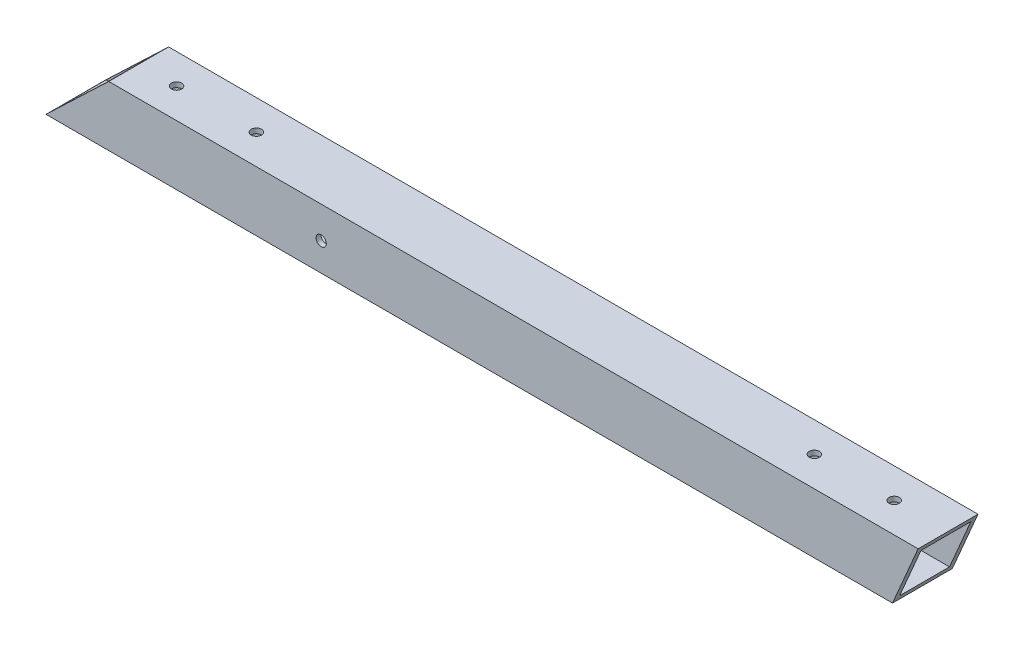
ISO-10303-21;
HEADER;
FILE_DESCRIPTION(('STEP AP214'),'2;1');
FILE_NAME('part.step','',(''),(''),'','','');
FILE_SCHEMA(('AUTOMOTIVE_DESIGN { 1 0 10303 214 1 1 1 1 }'));
ENDSEC;
DATA;
#1=APPLICATION_CONTEXT('core data for automotive mechanical design processes');
#2=APPLICATION_PROTOCOL_DEFINITION('international standard','automotive_design',2000,#1);
#3=PRODUCT_CONTEXT('',#1,'mechanical');
#4=PRODUCT('Part','Part','',(#3));
#5=PRODUCT_RELATED_PRODUCT_CATEGORY('part','',(#4));
#6=PRODUCT_DEFINITION_FORMATION('','',#4);
#7=PRODUCT_DEFINITION_CONTEXT('part definition',#1,'design');
#8=PRODUCT_DEFINITION('design','',#6,#7);
#9=PRODUCT_DEFINITION_SHAPE('','',#8);
#10=(LENGTH_UNIT() NAMED_UNIT(*) SI_UNIT(.MILLI.,.METRE.));
#11=(NAMED_UNIT(*) PLANE_ANGLE_UNIT() SI_UNIT($,.RADIAN.));
#12=(NAMED_UNIT(*) SI_UNIT($,.STERADIAN.) SOLID_ANGLE_UNIT());
#13=UNCERTAINTY_MEASURE_WITH_UNIT(LENGTH_MEASURE(1.E-05),#10,'distance_accuracy_value','');
#14=(GEOMETRIC_REPRESENTATION_CONTEXT(3) GLOBAL_UNCERTAINTY_ASSIGNED_CONTEXT((#13)) GLOBAL_UNIT_ASSIGNED_CONTEXT((#10,
#11,#12)) REPRESENTATION_CONTEXT('',''));
#15=CARTESIAN_POINT('',(0.,0.,0.));
#16=DIRECTION('',(0.,0.,1.));
#17=DIRECTION('',(1.,0.,0.));
#18=AXIS2_PLACEMENT_3D('',#15,#16,#17);
#19=CARTESIAN_POINT('',(-277.230526359531,38.0999999999998,-38.1));
#20=DIRECTION('',(0.,-1.,0.));
#21=DIRECTION('',(1.,0.,0.));
#22=AXIS2_PLACEMENT_3D('',#19,#20,#21);
#23=PLANE('',#22);
#24=CARTESIAN_POINT('',(-362.320526359531,38.1000000000001,-19.0499999999999));
#25=DIRECTION('',(0.,-1.,0.));
#26=DIRECTION('',(1.,0.,0.));
#27=AXIS2_PLACEMENT_3D('',#24,#25,#26);
#28=CIRCLE('',#27,3.2639);
#29=CARTESIAN_POINT('',(-359.056626359531,38.1000000000001,-19.0499999999999));
#30=VERTEX_POINT('',#29);
#31=EDGE_CURVE('E211',#30,#30,#28,.T.);
#32=ORIENTED_EDGE('',*,*,#31,.T.);
#33=EDGE_LOOP('',(#32));
#34=FACE_BOUND('',#33,.T.);
#35=CARTESIAN_POINT('',(-717.505350059974,38.1000000000002,-19.05));
#36=DIRECTION('',(0.,-1.,0.));
#37=DIRECTION('',(1.,0.,0.));
#38=AXIS2_PLACEMENT_3D('',#35,#36,#37);
#39=CIRCLE('',#38,3.2639);
#40=CARTESIAN_POINT('',(-714.241450059974,38.1000000000002,-19.05));
#41=VERTEX_POINT('',#40);
#42=EDGE_CURVE('E199',#41,#41,#39,.T.);
#43=ORIENTED_EDGE('',*,*,#42,.T.);
#44=EDGE_LOOP('',(#43));
#45=FACE_BOUND('',#44,.T.);
#46=CARTESIAN_POINT('',(-768.305350059974,38.1000000000002,-19.05));
#47=DIRECTION('',(0.,-1.,0.));
#48=DIRECTION('',(1.,0.,0.));
#49=AXIS2_PLACEMENT_3D('',#46,#47,#48);
#50=CIRCLE('',#49,3.2639);
#51=CARTESIAN_POINT('',(-765.041450059974,38.1000000000002,-19.05));
#52=VERTEX_POINT('',#51);
#53=EDGE_CURVE('E187',#52,#52,#50,.T.);
#54=ORIENTED_EDGE('',*,*,#53,.T.);
#55=EDGE_LOOP('',(#54));
#56=FACE_BOUND('',#55,.T.);
#57=CARTESIAN_POINT('',(-311.520526359531,38.1000000000001,-19.0499999999999));
#58=DIRECTION('',(0.,-1.,0.));
#59=DIRECTION('',(1.,0.,0.));
#60=AXIS2_PLACEMENT_3D('',#57,#58,#59);
#61=CIRCLE('',#60,3.2639);
#62=CARTESIAN_POINT('',(-308.256626359531,38.1000000000001,-19.0499999999999));
#63=VERTEX_POINT('',#62);
#64=EDGE_CURVE('E175',#63,#63,#61,.T.);
#65=ORIENTED_EDGE('',*,*,#64,.T.);
#66=EDGE_LOOP('',(#65));
#67=FACE_BOUND('',#66,.T.);
#68=DIRECTION('',(0.,0.,1.));
#69=VECTOR('',#68,1.);
#70=CARTESIAN_POINT('',(-277.230526359531,38.0999999999998,-38.1));
#71=LINE('',#70,#69);
#72=CARTESIAN_POINT('',(-277.230526359531,38.0999999999998,-38.1));
#73=VERTEX_POINT('',#72);
#74=CARTESIAN_POINT('',(-277.230526359531,38.0999999999998,0.));
#75=VERTEX_POINT('',#74);
#76=EDGE_CURVE('E162',#73,#75,#71,.T.);
#77=ORIENTED_EDGE('',*,*,#76,.F.);
#78=DIRECTION('',(-1.,0.,0.));
#79=VECTOR('',#78,1.);
#80=CARTESIAN_POINT('',(-277.230526359531,38.0999999999998,-38.1));
#81=LINE('',#80,#79);
#82=CARTESIAN_POINT('',(-792.435350059974,38.0999999999998,-38.1));
#83=VERTEX_POINT('',#82);
#84=EDGE_CURVE('E48',#73,#83,#81,.T.);
#85=ORIENTED_EDGE('',*,*,#84,.T.);
#86=DIRECTION('',(0.,0.,-1.));
#87=VECTOR('',#86,1.);
#88=CARTESIAN_POINT('',(-792.435350059974,38.0999999999998,-38.1));
#89=LINE('',#88,#87);
#90=CARTESIAN_POINT('',(-792.435350059974,38.0999999999998,0.));
#91=VERTEX_POINT('',#90);
#92=EDGE_CURVE('E125',#91,#83,#89,.T.);
#93=ORIENTED_EDGE('',*,*,#92,.F.);
#94=DIRECTION('',(-1.,0.,0.));
#95=VECTOR('',#94,1.);
#96=CARTESIAN_POINT('',(-277.230526359531,38.0999999999998,0.));
#97=LINE('',#96,#95);
#98=EDGE_CURVE('E129',#75,#91,#97,.T.);
#99=ORIENTED_EDGE('',*,*,#98,.F.);
#100=EDGE_LOOP('',(#77,#85,#93,#99));
#101=FACE_BOUND('',#100,.T.);
#102=ADVANCED_FACE('F33',(#34,#45,#56,#67,#101),#23,.F.);
#103=CARTESIAN_POINT('',(-277.230526359531,0.,0.));
#104=DIRECTION('',(0.,0.,-1.));
#105=DIRECTION('',(-0.690210929016375,0.723608232033296,0.));
#106=AXIS2_PLACEMENT_3D('',#103,#104,#105);
#107=PLANE('',#106);
#108=CARTESIAN_POINT('',(-657.229771370657,17.8823859969905,0.));
#109=DIRECTION('',(0.,0.,1.));
#110=DIRECTION('',(0.690210929016375,-0.723608232033296,0.));
#111=AXIS2_PLACEMENT_3D('',#108,#109,#110);
#112=CIRCLE('',#111,3.26389999999999);
#113=CARTESIAN_POINT('',(-654.97699191944,15.5206010884571,0.));
#114=VERTEX_POINT('',#113);
#115=EDGE_CURVE('E172',#114,#114,#112,.T.);
#116=ORIENTED_EDGE('',*,*,#115,.F.);
#117=EDGE_LOOP('',(#116));
#118=FACE_BOUND('',#117,.T.);
#119=DIRECTION('',(-0.393566430849752,-0.919296178882621,0.));
#120=VECTOR('',#119,1.);
#121=CARTESIAN_POINT('',(-291.015263179766,5.90148180223804,0.));
#122=LINE('',#121,#120);
#123=CARTESIAN_POINT('',(-293.541788561884,0.,0.));
#124=VERTEX_POINT('',#123);
#125=EDGE_CURVE('E159',#75,#124,#122,.T.);
#126=ORIENTED_EDGE('',*,*,#125,.F.);
#127=ORIENTED_EDGE('',*,*,#98,.T.);
#128=DIRECTION('',(-0.723608232033296,-0.690210929016375,0.));
#129=VECTOR('',#128,1.);
#130=CARTESIAN_POINT('',(-821.338830489497,10.5305263595312,0.));
#131=LINE('',#130,#129);
#132=CARTESIAN_POINT('',(-832.37889844707,0.,0.));
#133=VERTEX_POINT('',#132);
#134=EDGE_CURVE('E148',#91,#133,#131,.T.);
#135=ORIENTED_EDGE('',*,*,#134,.T.);
#136=DIRECTION('',(-1.,0.,0.));
#137=VECTOR('',#136,1.);
#138=CARTESIAN_POINT('',(-277.230526359531,0.,0.));
#139=LINE('',#138,#137);
#140=EDGE_CURVE('E127',#124,#133,#139,.T.);
#141=ORIENTED_EDGE('',*,*,#140,.F.);
#142=EDGE_LOOP('',(#126,#127,#135,#141));
#143=FACE_BOUND('',#142,.T.);
#144=ADVANCED_FACE('F238',(#118,#143),#107,.F.);
#145=CARTESIAN_POINT('',(-277.230526359531,0.,-38.1));
#146=DIRECTION('',(0.,1.,0.));
#147=DIRECTION('',(-1.,0.,0.));
#148=AXIS2_PLACEMENT_3D('',#145,#146,#147);
#149=PLANE('',#148);
#150=CARTESIAN_POINT('',(-311.520526359531,0.,-19.0499999999999));
#151=DIRECTION('',(0.,-1.,0.));
#152=DIRECTION('',(1.,0.,0.));
#153=AXIS2_PLACEMENT_3D('',#150,#151,#152);
#154=CIRCLE('',#153,3.26389999999999);
#155=CARTESIAN_POINT('',(-308.256626359531,0.,-19.0499999999999));
#156=VERTEX_POINT('',#155);
#157=EDGE_CURVE('E217',#156,#156,#154,.F.);
#158=ORIENTED_EDGE('',*,*,#157,.T.);
#159=EDGE_LOOP('',(#158));
#160=FACE_BOUND('',#159,.T.);
#161=CARTESIAN_POINT('',(-362.320526359531,0.,-19.0499999999999));
#162=DIRECTION('',(0.,-1.,0.));
#163=DIRECTION('',(1.,0.,0.));
#164=AXIS2_PLACEMENT_3D('',#161,#162,#163);
#165=CIRCLE('',#164,3.26389999999999);
#166=CARTESIAN_POINT('',(-359.056626359531,0.,-19.0499999999999));
#167=VERTEX_POINT('',#166);
#168=EDGE_CURVE('E205',#167,#167,#165,.F.);
#169=ORIENTED_EDGE('',*,*,#168,.T.);
#170=EDGE_LOOP('',(#169));
#171=FACE_BOUND('',#170,.T.);
#172=CARTESIAN_POINT('',(-717.505350059973,2.22044604925031E-13,-19.05));
#173=DIRECTION('',(0.,-1.,0.));
#174=DIRECTION('',(1.,0.,0.));
#175=AXIS2_PLACEMENT_3D('',#172,#173,#174);
#176=CIRCLE('',#175,3.26389999999999);
#177=CARTESIAN_POINT('',(-714.241450059974,2.21138690692513E-13,-19.05));
#178=VERTEX_POINT('',#177);
#179=EDGE_CURVE('E193',#178,#178,#176,.F.);
#180=ORIENTED_EDGE('',*,*,#179,.T.);
#181=EDGE_LOOP('',(#180));
#182=FACE_BOUND('',#181,.T.);
#183=CARTESIAN_POINT('',(-768.305350059973,2.22044604925031E-13,-19.05));
#184=DIRECTION('',(0.,-1.,0.));
#185=DIRECTION('',(1.,0.,0.));
#186=AXIS2_PLACEMENT_3D('',#183,#184,#185);
#187=CIRCLE('',#186,3.26389999999999);
#188=CARTESIAN_POINT('',(-765.041450059973,2.21138690692513E-13,-19.05));
#189=VERTEX_POINT('',#188);
#190=EDGE_CURVE('E181',#189,#189,#187,.F.);
#191=ORIENTED_EDGE('',*,*,#190,.T.);
#192=EDGE_LOOP('',(#191));
#193=FACE_BOUND('',#192,.T.);
#194=DIRECTION('',(0.,0.,-1.));
#195=VECTOR('',#194,1.);
#196=CARTESIAN_POINT('',(-293.541788561884,0.,-38.1));
#197=LINE('',#196,#195);
#198=CARTESIAN_POINT('',(-293.541788561884,0.,-38.1));
#199=VERTEX_POINT('',#198);
#200=EDGE_CURVE('E156',#124,#199,#197,.T.);
#201=ORIENTED_EDGE('',*,*,#200,.F.);
#202=ORIENTED_EDGE('',*,*,#140,.T.);
#203=DIRECTION('',(0.,0.,1.));
#204=VECTOR('',#203,1.);
#205=CARTESIAN_POINT('',(-832.37889844707,0.,-38.1));
#206=LINE('',#205,#204);
#207=CARTESIAN_POINT('',(-832.37889844707,-1.11022302462516E-13,-38.1));
#208=VERTEX_POINT('',#207);
#209=EDGE_CURVE('E139',#208,#133,#206,.T.);
#210=ORIENTED_EDGE('',*,*,#209,.F.);
#211=DIRECTION('',(-1.,0.,0.));
#212=VECTOR('',#211,1.);
#213=CARTESIAN_POINT('',(-277.230526359531,0.,-38.1));
#214=LINE('',#213,#212);
#215=EDGE_CURVE('E124',#199,#208,#214,.T.);
#216=ORIENTED_EDGE('',*,*,#215,.F.);
#217=EDGE_LOOP('',(#201,#202,#210,#216));
#218=FACE_BOUND('',#217,.T.);
#219=ADVANCED_FACE('F234',(#160,#171,#182,#193,#218),#149,.F.);
#220=CARTESIAN_POINT('',(-277.230526359531,0.,-38.1));
#221=DIRECTION('',(0.,0.,1.));
#222=DIRECTION('',(0.690210929016375,-0.723608232033296,0.));
#223=AXIS2_PLACEMENT_3D('',#220,#221,#222);
#224=PLANE('',#223);
#225=CARTESIAN_POINT('',(-657.229771370657,17.8823859969905,-38.1));
#226=DIRECTION('',(0.,0.,1.));
#227=DIRECTION('',(0.690210929016375,-0.723608232033296,0.));
#228=AXIS2_PLACEMENT_3D('',#225,#226,#227);
#229=CIRCLE('',#228,3.26389999999999);
#230=CARTESIAN_POINT('',(-654.97699191944,15.5206010884571,-38.1));
#231=VERTEX_POINT('',#230);
#232=EDGE_CURVE('E110',#231,#231,#229,.T.);
#233=ORIENTED_EDGE('',*,*,#232,.T.);
#234=EDGE_LOOP('',(#233));
#235=FACE_BOUND('',#234,.T.);
#236=DIRECTION('',(0.393566430849752,0.919296178882621,0.));
#237=VECTOR('',#236,1.);
#238=CARTESIAN_POINT('',(-291.015263179766,5.90148180223804,-38.1));
#239=LINE('',#238,#237);
#240=EDGE_CURVE('E153',#199,#73,#239,.T.);
#241=ORIENTED_EDGE('',*,*,#240,.F.);
#242=ORIENTED_EDGE('',*,*,#215,.T.);
#243=DIRECTION('',(-0.723608232033296,-0.690210929016375,0.));
#244=VECTOR('',#243,1.);
#245=CARTESIAN_POINT('',(-821.338830489497,10.5305263595312,-38.1));
#246=LINE('',#245,#244);
#247=EDGE_CURVE('E150',#83,#208,#246,.T.);
#248=ORIENTED_EDGE('',*,*,#247,.F.);
#249=ORIENTED_EDGE('',*,*,#84,.F.);
#250=EDGE_LOOP('',(#241,#242,#248,#249));
#251=FACE_BOUND('',#250,.T.);
#252=ADVANCED_FACE('F237',(#235,#251),#224,.F.);
#253=CARTESIAN_POINT('',(-821.338830489497,10.5305263595312,-38.1));
#254=DIRECTION('',(-0.690210929016375,0.723608232033296,0.));
#255=DIRECTION('',(-0.723608232033296,-0.690210929016375,0.));
#256=AXIS2_PLACEMENT_3D('',#253,#254,#255);
#257=PLANE('',#256);
#258=DIRECTION('',(0.723608232033296,0.690210929016375,0.));
#259=VECTOR('',#258,1.);
#260=CARTESIAN_POINT('',(-540.112555397144,278.777127216852,-3.175));
#261=LINE('',#260,#259);
#262=CARTESIAN_POINT('',(-829.050269414812,3.17499999999993,-3.175));
#263=VERTEX_POINT('',#262);
#264=CARTESIAN_POINT('',(-795.763979092232,34.9249999999999,-3.175));
#265=VERTEX_POINT('',#264);
#266=EDGE_CURVE('E41',#263,#265,#261,.T.);
#267=ORIENTED_EDGE('',*,*,#266,.F.);
#268=DIRECTION('',(0.,0.,1.));
#269=VECTOR('',#268,1.);
#270=CARTESIAN_POINT('',(-829.050269414812,3.17499999999982,-34.925));
#271=LINE('',#270,#269);
#272=CARTESIAN_POINT('',(-829.050269414812,3.17499999999982,-34.925));
#273=VERTEX_POINT('',#272);
#274=EDGE_CURVE('E145',#273,#263,#271,.T.);
#275=ORIENTED_EDGE('',*,*,#274,.F.);
#276=DIRECTION('',(-0.723608232033296,-0.690210929016375,0.));
#277=VECTOR('',#276,1.);
#278=CARTESIAN_POINT('',(-540.112555397144,278.777127216852,-34.925));
#279=LINE('',#278,#277);
#280=CARTESIAN_POINT('',(-795.763979092232,34.9249999999999,-34.925));
#281=VERTEX_POINT('',#280);
#282=EDGE_CURVE('E143',#281,#273,#279,.T.);
#283=ORIENTED_EDGE('',*,*,#282,.F.);
#284=DIRECTION('',(0.,0.,-1.));
#285=VECTOR('',#284,1.);
#286=CARTESIAN_POINT('',(-795.763979092232,34.9249999999999,-34.925));
#287=LINE('',#286,#285);
#288=EDGE_CURVE('E115',#265,#281,#287,.T.);
#289=ORIENTED_EDGE('',*,*,#288,.F.);
#290=EDGE_LOOP('',(#267,#275,#283,#289));
#291=FACE_BOUND('',#290,.T.);
#292=ORIENTED_EDGE('',*,*,#92,.T.);
#293=ORIENTED_EDGE('',*,*,#247,.T.);
#294=ORIENTED_EDGE('',*,*,#209,.T.);
#295=ORIENTED_EDGE('',*,*,#134,.F.);
#296=EDGE_LOOP('',(#292,#293,#294,#295));
#297=FACE_BOUND('',#296,.T.);
#298=ADVANCED_FACE('F252',(#291,#297),#257,.T.);
#299=CARTESIAN_POINT('',(-277.230526359531,34.9249999999999,-34.925));
#300=DIRECTION('',(0.,-1.,0.));
#301=DIRECTION('',(1.,0.,0.));
#302=AXIS2_PLACEMENT_3D('',#299,#300,#301);
#303=PLANE('',#302);
#304=CARTESIAN_POINT('',(-362.320526359531,34.925,-19.0499999999999));
#305=DIRECTION('',(0.,1.,0.));
#306=DIRECTION('',(-1.,0.,0.));
#307=AXIS2_PLACEMENT_3D('',#304,#305,#306);
#308=CIRCLE('',#307,3.26389999999999);
#309=CARTESIAN_POINT('',(-365.584426359532,34.925,-19.0499999999999));
#310=VERTEX_POINT('',#309);
#311=EDGE_CURVE('E214',#310,#310,#308,.T.);
#312=ORIENTED_EDGE('',*,*,#311,.T.);
#313=EDGE_LOOP('',(#312));
#314=FACE_BOUND('',#313,.T.);
#315=CARTESIAN_POINT('',(-717.505350059974,34.9250000000001,-19.05));
#316=DIRECTION('',(0.,1.,0.));
#317=DIRECTION('',(-1.,0.,0.));
#318=AXIS2_PLACEMENT_3D('',#315,#316,#317);
#319=CIRCLE('',#318,3.26389999999999);
#320=CARTESIAN_POINT('',(-720.769250059974,34.9250000000001,-19.05));
#321=VERTEX_POINT('',#320);
#322=EDGE_CURVE('E202',#321,#321,#319,.T.);
#323=ORIENTED_EDGE('',*,*,#322,.T.);
#324=EDGE_LOOP('',(#323));
#325=FACE_BOUND('',#324,.T.);
#326=CARTESIAN_POINT('',(-768.305350059973,34.9250000000001,-19.05));
#327=DIRECTION('',(0.,1.,0.));
#328=DIRECTION('',(-1.,0.,0.));
#329=AXIS2_PLACEMENT_3D('',#326,#327,#328);
#330=CIRCLE('',#329,3.26389999999999);
#331=CARTESIAN_POINT('',(-771.569250059973,34.9250000000001,-19.05));
#332=VERTEX_POINT('',#331);
#333=EDGE_CURVE('E190',#332,#332,#330,.T.);
#334=ORIENTED_EDGE('',*,*,#333,.T.);
#335=EDGE_LOOP('',(#334));
#336=FACE_BOUND('',#335,.T.);
#337=CARTESIAN_POINT('',(-311.520526359531,34.925,-19.0499999999999));
#338=DIRECTION('',(0.,1.,0.));
#339=DIRECTION('',(-1.,0.,0.));
#340=AXIS2_PLACEMENT_3D('',#337,#338,#339);
#341=CIRCLE('',#340,3.26389999999999);
#342=CARTESIAN_POINT('',(-314.784426359531,34.925,-19.0499999999999));
#343=VERTEX_POINT('',#342);
#344=EDGE_CURVE('E178',#343,#343,#341,.T.);
#345=ORIENTED_EDGE('',*,*,#344,.T.);
#346=EDGE_LOOP('',(#345));
#347=FACE_BOUND('',#346,.T.);
#348=DIRECTION('',(-1.,0.,0.));
#349=VECTOR('',#348,1.);
#350=CARTESIAN_POINT('',(-277.230526359531,34.9249999999999,-34.925));
#351=LINE('',#350,#349);
#352=CARTESIAN_POINT('',(-278.589798209727,34.9249999999999,-34.925));
#353=VERTEX_POINT('',#352);
#354=EDGE_CURVE('E105',#353,#281,#351,.T.);
#355=ORIENTED_EDGE('',*,*,#354,.F.);
#356=DIRECTION('',(0.,0.,1.));
#357=VECTOR('',#356,1.);
#358=CARTESIAN_POINT('',(-278.589798209727,34.9249999999999,-34.925));
#359=LINE('',#358,#357);
#360=CARTESIAN_POINT('',(-278.589798209727,34.9249999999999,-3.175));
#361=VERTEX_POINT('',#360);
#362=EDGE_CURVE('E11',#353,#361,#359,.T.);
#363=ORIENTED_EDGE('',*,*,#362,.T.);
#364=DIRECTION('',(-1.,0.,0.));
#365=VECTOR('',#364,1.);
#366=CARTESIAN_POINT('',(-277.230526359531,34.9249999999999,-3.175));
#367=LINE('',#366,#365);
#368=EDGE_CURVE('E130',#361,#265,#367,.T.);
#369=ORIENTED_EDGE('',*,*,#368,.T.);
#370=ORIENTED_EDGE('',*,*,#288,.T.);
#371=EDGE_LOOP('',(#355,#363,#369,#370));
#372=FACE_BOUND('',#371,.T.);
#373=ADVANCED_FACE('F113',(#314,#325,#336,#347,#372),#303,.T.);
#374=CARTESIAN_POINT('',(-277.230526359531,3.17499999999982,-34.925));
#375=DIRECTION('',(0.,0.,1.));
#376=DIRECTION('',(0.690210929016375,-0.723608232033296,0.));
#377=AXIS2_PLACEMENT_3D('',#374,#375,#376);
#378=PLANE('',#377);
#379=CARTESIAN_POINT('',(-657.229771370657,17.8823859969905,-34.925));
#380=DIRECTION('',(0.,0.,1.));
#381=DIRECTION('',(0.690210929016375,-0.723608232033296,0.));
#382=AXIS2_PLACEMENT_3D('',#379,#380,#381);
#383=CIRCLE('',#382,3.26389999999999);
#384=CARTESIAN_POINT('',(-654.97699191944,15.5206010884571,-34.925));
#385=VERTEX_POINT('',#384);
#386=EDGE_CURVE('E36',#385,#385,#383,.T.);
#387=ORIENTED_EDGE('',*,*,#386,.F.);
#388=EDGE_LOOP('',(#387));
#389=FACE_BOUND('',#388,.T.);
#390=DIRECTION('',(-1.,0.,0.));
#391=VECTOR('',#390,1.);
#392=CARTESIAN_POINT('',(-277.230526359531,3.17499999999982,-34.925));
#393=LINE('',#392,#391);
#394=CARTESIAN_POINT('',(-292.182516711688,3.17499999999982,-34.925));
#395=VERTEX_POINT('',#394);
#396=EDGE_CURVE('E107',#395,#273,#393,.T.);
#397=ORIENTED_EDGE('',*,*,#396,.F.);
#398=DIRECTION('',(0.393566430849752,0.919296178882621,0.));
#399=VECTOR('',#398,1.);
#400=CARTESIAN_POINT('',(-289.866535111413,8.58469165205145,-34.925));
#401=LINE('',#400,#399);
#402=EDGE_CURVE('E98',#395,#353,#401,.T.);
#403=ORIENTED_EDGE('',*,*,#402,.T.);
#404=ORIENTED_EDGE('',*,*,#354,.T.);
#405=ORIENTED_EDGE('',*,*,#282,.T.);
#406=EDGE_LOOP('',(#397,#403,#404,#405));
#407=FACE_BOUND('',#406,.T.);
#408=ADVANCED_FACE('F103',(#389,#407),#378,.T.);
#409=CARTESIAN_POINT('',(-277.230526359531,3.17499999999982,-34.925));
#410=DIRECTION('',(0.,1.,0.));
#411=DIRECTION('',(-1.,0.,0.));
#412=AXIS2_PLACEMENT_3D('',#409,#410,#411);
#413=PLANE('',#412);
#414=CARTESIAN_POINT('',(-311.520526359531,3.17499999999993,-19.0499999999999));
#415=DIRECTION('',(0.,-1.,0.));
#416=DIRECTION('',(1.,0.,0.));
#417=AXIS2_PLACEMENT_3D('',#414,#415,#416);
#418=CIRCLE('',#417,3.26389999999999);
#419=CARTESIAN_POINT('',(-308.256626359531,3.17499999999993,-19.0499999999999));
#420=VERTEX_POINT('',#419);
#421=EDGE_CURVE('E220',#420,#420,#418,.T.);
#422=ORIENTED_EDGE('',*,*,#421,.T.);
#423=EDGE_LOOP('',(#422));
#424=FACE_BOUND('',#423,.T.);
#425=CARTESIAN_POINT('',(-362.320526359531,3.17500000000004,-19.0499999999999));
#426=DIRECTION('',(0.,-1.,0.));
#427=DIRECTION('',(1.,0.,0.));
#428=AXIS2_PLACEMENT_3D('',#425,#426,#427);
#429=CIRCLE('',#428,3.26389999999999);
#430=CARTESIAN_POINT('',(-359.056626359531,3.17500000000004,-19.0499999999999));
#431=VERTEX_POINT('',#430);
#432=EDGE_CURVE('E208',#431,#431,#429,.T.);
#433=ORIENTED_EDGE('',*,*,#432,.T.);
#434=EDGE_LOOP('',(#433));
#435=FACE_BOUND('',#434,.T.);
#436=CARTESIAN_POINT('',(-717.505350059973,3.17500000000015,-19.05));
#437=DIRECTION('',(0.,-1.,0.));
#438=DIRECTION('',(1.,0.,0.));
#439=AXIS2_PLACEMENT_3D('',#436,#437,#438);
#440=CIRCLE('',#439,3.26389999999999);
#441=CARTESIAN_POINT('',(-714.241450059974,3.17500000000015,-19.05));
#442=VERTEX_POINT('',#441);
#443=EDGE_CURVE('E196',#442,#442,#440,.T.);
#444=ORIENTED_EDGE('',*,*,#443,.T.);
#445=EDGE_LOOP('',(#444));
#446=FACE_BOUND('',#445,.T.);
#447=CARTESIAN_POINT('',(-768.305350059973,3.17500000000015,-19.05));
#448=DIRECTION('',(0.,-1.,0.));
#449=DIRECTION('',(1.,0.,0.));
#450=AXIS2_PLACEMENT_3D('',#447,#448,#449);
#451=CIRCLE('',#450,3.26389999999999);
#452=CARTESIAN_POINT('',(-765.041450059973,3.17500000000015,-19.05));
#453=VERTEX_POINT('',#452);
#454=EDGE_CURVE('E184',#453,#453,#451,.T.);
#455=ORIENTED_EDGE('',*,*,#454,.T.);
#456=EDGE_LOOP('',(#455));
#457=FACE_BOUND('',#456,.T.);
#458=DIRECTION('',(-1.,0.,0.));
#459=VECTOR('',#458,1.);
#460=CARTESIAN_POINT('',(-277.230526359531,3.17499999999982,-3.175));
#461=LINE('',#460,#459);
#462=CARTESIAN_POINT('',(-292.182516711688,3.17499999999982,-3.175));
#463=VERTEX_POINT('',#462);
#464=EDGE_CURVE('E119',#463,#263,#461,.T.);
#465=ORIENTED_EDGE('',*,*,#464,.F.);
#466=DIRECTION('',(0.,0.,-1.));
#467=VECTOR('',#466,1.);
#468=CARTESIAN_POINT('',(-292.182516711688,3.17499999999982,-34.925));
#469=LINE('',#468,#467);
#470=EDGE_CURVE('E109',#463,#395,#469,.T.);
#471=ORIENTED_EDGE('',*,*,#470,.T.);
#472=ORIENTED_EDGE('',*,*,#396,.T.);
#473=ORIENTED_EDGE('',*,*,#274,.T.);
#474=EDGE_LOOP('',(#465,#471,#472,#473));
#475=FACE_BOUND('',#474,.T.);
#476=ADVANCED_FACE('F224',(#424,#435,#446,#457,#475),#413,.T.);
#477=CARTESIAN_POINT('',(-277.230526359531,3.17499999999982,-3.175));
#478=DIRECTION('',(0.,0.,-1.));
#479=DIRECTION('',(-0.690210929016375,0.723608232033296,0.));
#480=AXIS2_PLACEMENT_3D('',#477,#478,#479);
#481=PLANE('',#480);
#482=CARTESIAN_POINT('',(-657.229771370657,17.8823859969905,-3.175));
#483=DIRECTION('',(0.,0.,-1.));
#484=DIRECTION('',(-0.690210929016375,0.723608232033296,0.));
#485=AXIS2_PLACEMENT_3D('',#482,#483,#484);
#486=CIRCLE('',#485,3.26389999999999);
#487=CARTESIAN_POINT('',(-659.482550821873,20.244170905524,-3.175));
#488=VERTEX_POINT('',#487);
#489=EDGE_CURVE('E169',#488,#488,#486,.T.);
#490=ORIENTED_EDGE('',*,*,#489,.F.);
#491=EDGE_LOOP('',(#490));
#492=FACE_BOUND('',#491,.T.);
#493=ORIENTED_EDGE('',*,*,#368,.F.);
#494=DIRECTION('',(-0.393566430849752,-0.919296178882621,0.));
#495=VECTOR('',#494,1.);
#496=CARTESIAN_POINT('',(-289.866535111413,8.58469165205145,-3.175));
#497=LINE('',#496,#495);
#498=EDGE_CURVE('E56',#361,#463,#497,.T.);
#499=ORIENTED_EDGE('',*,*,#498,.T.);
#500=ORIENTED_EDGE('',*,*,#464,.T.);
#501=ORIENTED_EDGE('',*,*,#266,.T.);
#502=EDGE_LOOP('',(#493,#499,#500,#501));
#503=FACE_BOUND('',#502,.T.);
#504=ADVANCED_FACE('F298',(#492,#503),#481,.T.);
#505=CARTESIAN_POINT('',(-277.230526359531,38.0999999999999,0.));
#506=DIRECTION('',(0.919296178882621,-0.393566430849752,0.));
#507=DIRECTION('',(0.393566430849752,0.919296178882621,0.));
#508=AXIS2_PLACEMENT_3D('',#505,#506,#507);
#509=PLANE('',#508);
#510=ORIENTED_EDGE('',*,*,#498,.F.);
#511=ORIENTED_EDGE('',*,*,#362,.F.);
#512=ORIENTED_EDGE('',*,*,#402,.F.);
#513=ORIENTED_EDGE('',*,*,#470,.F.);
#514=EDGE_LOOP('',(#510,#511,#512,#513));
#515=FACE_BOUND('',#514,.T.);
#516=ORIENTED_EDGE('',*,*,#200,.T.);
#517=ORIENTED_EDGE('',*,*,#240,.T.);
#518=ORIENTED_EDGE('',*,*,#76,.T.);
#519=ORIENTED_EDGE('',*,*,#125,.T.);
#520=EDGE_LOOP('',(#516,#517,#518,#519));
#521=FACE_BOUND('',#520,.T.);
#522=ADVANCED_FACE('F96',(#515,#521),#509,.T.);
#523=CARTESIAN_POINT('',(-657.229771370657,17.8823859969905,0.));
#524=DIRECTION('',(0.,0.,1.));
#525=DIRECTION('',(0.690210929016375,-0.723608232033296,0.));
#526=AXIS2_PLACEMENT_3D('',#523,#524,#525);
#527=CYLINDRICAL_SURFACE('',#526,3.26389999999999);
#528=ORIENTED_EDGE('',*,*,#386,.T.);
#529=EDGE_LOOP('',(#528));
#530=FACE_BOUND('',#529,.T.);
#531=ORIENTED_EDGE('',*,*,#232,.F.);
#532=EDGE_LOOP('',(#531));
#533=FACE_BOUND('',#532,.T.);
#534=ADVANCED_FACE('F289',(#530,#533),#527,.F.);
#535=ORIENTED_EDGE('',*,*,#489,.T.);
#536=EDGE_LOOP('',(#535));
#537=FACE_BOUND('',#536,.T.);
#538=ORIENTED_EDGE('',*,*,#115,.T.);
#539=EDGE_LOOP('',(#538));
#540=FACE_BOUND('',#539,.T.);
#541=ADVANCED_FACE('F279',(#537,#540),#527,.F.);
#542=CARTESIAN_POINT('',(-311.520526359531,38.1000000000001,-19.0499999999999));
#543=DIRECTION('',(0.,1.,0.));
#544=DIRECTION('',(1.,0.,0.));
#545=AXIS2_PLACEMENT_3D('',#542,#543,#544);
#546=CYLINDRICAL_SURFACE('',#545,3.26389999999999);
#547=ORIENTED_EDGE('',*,*,#344,.F.);
#548=EDGE_LOOP('',(#547));
#549=FACE_BOUND('',#548,.T.);
#550=ORIENTED_EDGE('',*,*,#64,.F.);
#551=EDGE_LOOP('',(#550));
#552=FACE_BOUND('',#551,.T.);
#553=ADVANCED_FACE('F276',(#549,#552),#546,.F.);
#554=CARTESIAN_POINT('',(-768.305350059974,38.1000000000002,-19.05));
#555=DIRECTION('',(0.,1.,0.));
#556=DIRECTION('',(1.,0.,0.));
#557=AXIS2_PLACEMENT_3D('',#554,#555,#556);
#558=CYLINDRICAL_SURFACE('',#557,3.26389999999999);
#559=ORIENTED_EDGE('',*,*,#454,.F.);
#560=EDGE_LOOP('',(#559));
#561=FACE_BOUND('',#560,.T.);
#562=ORIENTED_EDGE('',*,*,#190,.F.);
#563=EDGE_LOOP('',(#562));
#564=FACE_BOUND('',#563,.T.);
#565=ADVANCED_FACE('F278',(#561,#564),#558,.F.);
#566=CARTESIAN_POINT('',(-768.305350059974,38.1000000000002,-19.05));
#567=DIRECTION('',(0.,1.,0.));
#568=DIRECTION('',(1.,0.,0.));
#569=AXIS2_PLACEMENT_3D('',#566,#567,#568);
#570=CYLINDRICAL_SURFACE('',#569,3.26389999999999);
#571=ORIENTED_EDGE('',*,*,#333,.F.);
#572=EDGE_LOOP('',(#571));
#573=FACE_BOUND('',#572,.T.);
#574=ORIENTED_EDGE('',*,*,#53,.F.);
#575=EDGE_LOOP('',(#574));
#576=FACE_BOUND('',#575,.T.);
#577=ADVANCED_FACE('F286',(#573,#576),#570,.F.);
#578=CARTESIAN_POINT('',(-717.505350059974,38.1000000000002,-19.05));
#579=DIRECTION('',(0.,1.,0.));
#580=DIRECTION('',(1.,0.,0.));
#581=AXIS2_PLACEMENT_3D('',#578,#579,#580);
#582=CYLINDRICAL_SURFACE('',#581,3.26389999999999);
#583=ORIENTED_EDGE('',*,*,#443,.F.);
#584=EDGE_LOOP('',(#583));
#585=FACE_BOUND('',#584,.T.);
#586=ORIENTED_EDGE('',*,*,#179,.F.);
#587=EDGE_LOOP('',(#586));
#588=FACE_BOUND('',#587,.T.);
#589=ADVANCED_FACE('F320',(#585,#588),#582,.F.);
#590=CARTESIAN_POINT('',(-717.505350059974,38.1000000000002,-19.05));
#591=DIRECTION('',(0.,1.,0.));
#592=DIRECTION('',(1.,0.,0.));
#593=AXIS2_PLACEMENT_3D('',#590,#591,#592);
#594=CYLINDRICAL_SURFACE('',#593,3.26389999999999);
#595=ORIENTED_EDGE('',*,*,#322,.F.);
#596=EDGE_LOOP('',(#595));
#597=FACE_BOUND('',#596,.T.);
#598=ORIENTED_EDGE('',*,*,#42,.F.);
#599=EDGE_LOOP('',(#598));
#600=FACE_BOUND('',#599,.T.);
#601=ADVANCED_FACE('F324',(#597,#600),#594,.F.);
#602=CARTESIAN_POINT('',(-362.320526359531,38.1000000000001,-19.0499999999999));
#603=DIRECTION('',(0.,1.,0.));
#604=DIRECTION('',(1.,0.,0.));
#605=AXIS2_PLACEMENT_3D('',#602,#603,#604);
#606=CYLINDRICAL_SURFACE('',#605,3.26389999999999);
#607=ORIENTED_EDGE('',*,*,#432,.F.);
#608=EDGE_LOOP('',(#607));
#609=FACE_BOUND('',#608,.T.);
#610=ORIENTED_EDGE('',*,*,#168,.F.);
#611=EDGE_LOOP('',(#610));
#612=FACE_BOUND('',#611,.T.);
#613=ADVANCED_FACE('F330',(#609,#612),#606,.F.);
#614=CARTESIAN_POINT('',(-362.320526359531,38.1000000000001,-19.0499999999999));
#615=DIRECTION('',(0.,1.,0.));
#616=DIRECTION('',(1.,0.,0.));
#617=AXIS2_PLACEMENT_3D('',#614,#615,#616);
#618=CYLINDRICAL_SURFACE('',#617,3.26389999999999);
#619=ORIENTED_EDGE('',*,*,#311,.F.);
#620=EDGE_LOOP('',(#619));
#621=FACE_BOUND('',#620,.T.);
#622=ORIENTED_EDGE('',*,*,#31,.F.);
#623=EDGE_LOOP('',(#622));
#624=FACE_BOUND('',#623,.T.);
#625=ADVANCED_FACE('F230',(#621,#624),#618,.F.);
#626=CARTESIAN_POINT('',(-311.520526359531,38.1000000000001,-19.0499999999999));
#627=DIRECTION('',(0.,1.,0.));
#628=DIRECTION('',(1.,0.,0.));
#629=AXIS2_PLACEMENT_3D('',#626,#627,#628);
#630=CYLINDRICAL_SURFACE('',#629,3.26389999999999);
#631=ORIENTED_EDGE('',*,*,#421,.F.);
#632=EDGE_LOOP('',(#631));
#633=FACE_BOUND('',#632,.T.);
#634=ORIENTED_EDGE('',*,*,#157,.F.);
#635=EDGE_LOOP('',(#634));
#636=FACE_BOUND('',#635,.T.);
#637=ADVANCED_FACE('F227',(#633,#636),#630,.F.);
#638=CLOSED_SHELL('',(#102,#144,#219,#252,#298,#373,#408,#476,#504,#522,#534,#541,#553,#565,
#577,#589,#601,#613,#625,#637));
#639=MANIFOLD_SOLID_BREP('B2',#638);
#640=ADVANCED_BREP_SHAPE_REPRESENTATION('',(#18,#639),#14);
#641=SHAPE_DEFINITION_REPRESENTATION(#9,#640);
ENDSEC;
END-ISO-10303-21;
